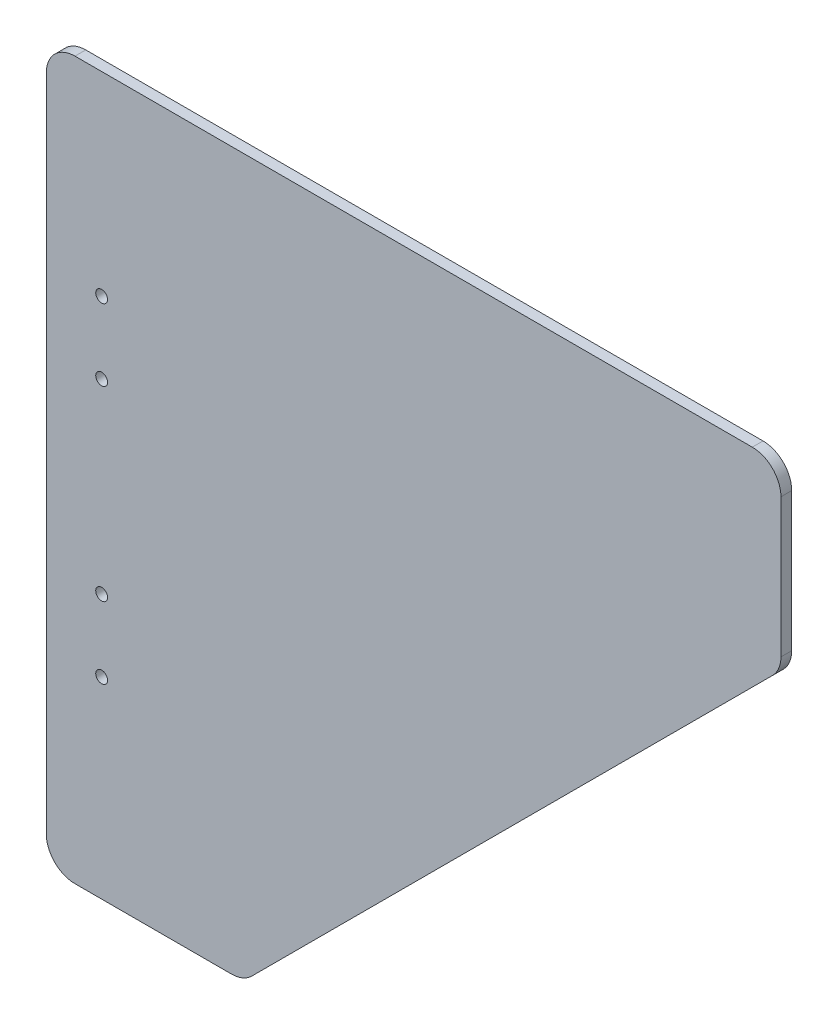
ISO-10303-21;
HEADER;
FILE_DESCRIPTION(('STEP AP214'),'2;1');
FILE_NAME('part.step','',(''),(''),'','','');
FILE_SCHEMA(('AUTOMOTIVE_DESIGN { 1 0 10303 214 1 1 1 1 }'));
ENDSEC;
DATA;
#1=APPLICATION_CONTEXT('core data for automotive mechanical design processes');
#2=APPLICATION_PROTOCOL_DEFINITION('international standard','automotive_design',2000,#1);
#3=PRODUCT_CONTEXT('',#1,'mechanical');
#4=PRODUCT('Part','Part','',(#3));
#5=PRODUCT_RELATED_PRODUCT_CATEGORY('part','',(#4));
#6=PRODUCT_DEFINITION_FORMATION('','',#4);
#7=PRODUCT_DEFINITION_CONTEXT('part definition',#1,'design');
#8=PRODUCT_DEFINITION('design','',#6,#7);
#9=PRODUCT_DEFINITION_SHAPE('','',#8);
#10=(LENGTH_UNIT() NAMED_UNIT(*) SI_UNIT(.MILLI.,.METRE.));
#11=(NAMED_UNIT(*) PLANE_ANGLE_UNIT() SI_UNIT($,.RADIAN.));
#12=(NAMED_UNIT(*) SI_UNIT($,.STERADIAN.) SOLID_ANGLE_UNIT());
#13=UNCERTAINTY_MEASURE_WITH_UNIT(LENGTH_MEASURE(1.E-05),#10,'distance_accuracy_value','');
#14=(GEOMETRIC_REPRESENTATION_CONTEXT(3) GLOBAL_UNCERTAINTY_ASSIGNED_CONTEXT((#13)) GLOBAL_UNIT_ASSIGNED_CONTEXT((#10,
#11,#12)) REPRESENTATION_CONTEXT('',''));
#15=CARTESIAN_POINT('',(0.,0.,0.));
#16=DIRECTION('',(0.,0.,1.));
#17=DIRECTION('',(1.,0.,0.));
#18=AXIS2_PLACEMENT_3D('',#15,#16,#17);
#19=CARTESIAN_POINT('',(51.6862915010169,8.00000000000001,3.));
#20=DIRECTION('',(0.,0.,-1.));
#21=DIRECTION('',(-1.,0.,0.));
#22=AXIS2_PLACEMENT_3D('',#19,#20,#21);
#23=CYLINDRICAL_SURFACE('',#22,8.00000000000001);
#24=CARTESIAN_POINT('',(51.6862915010169,8.00000000000001,0.));
#25=DIRECTION('',(0.,0.,1.));
#26=DIRECTION('',(-1.,0.,0.));
#27=AXIS2_PLACEMENT_3D('',#24,#25,#26);
#28=CIRCLE('',#27,8.00000000000001);
#29=CARTESIAN_POINT('',(51.6862915010169,0.,0.));
#30=VERTEX_POINT('',#29);
#31=CARTESIAN_POINT('',(57.3431457505093,2.34314575050765,0.));
#32=VERTEX_POINT('',#31);
#33=EDGE_CURVE('E144',#30,#32,#28,.T.);
#34=ORIENTED_EDGE('',*,*,#33,.T.);
#35=DIRECTION('',(0.,0.,-1.));
#36=VECTOR('',#35,1.);
#37=CARTESIAN_POINT('',(57.3431457505093,2.34314575050765,3.));
#38=LINE('',#37,#36);
#39=CARTESIAN_POINT('',(57.3431457505093,2.34314575050765,3.));
#40=VERTEX_POINT('',#39);
#41=EDGE_CURVE('E11',#40,#32,#38,.T.);
#42=ORIENTED_EDGE('',*,*,#41,.F.);
#43=CARTESIAN_POINT('',(51.6862915010169,8.00000000000001,3.));
#44=DIRECTION('',(0.,0.,1.));
#45=DIRECTION('',(-1.,0.,0.));
#46=AXIS2_PLACEMENT_3D('',#43,#44,#45);
#47=CIRCLE('',#46,8.00000000000001);
#48=CARTESIAN_POINT('',(51.6862915010169,0.,3.));
#49=VERTEX_POINT('',#48);
#50=EDGE_CURVE('E163',#49,#40,#47,.T.);
#51=ORIENTED_EDGE('',*,*,#50,.F.);
#52=DIRECTION('',(0.,0.,-1.));
#53=VECTOR('',#52,1.);
#54=CARTESIAN_POINT('',(51.6862915010169,0.,3.));
#55=LINE('',#54,#53);
#56=EDGE_CURVE('E140',#49,#30,#55,.T.);
#57=ORIENTED_EDGE('',*,*,#56,.T.);
#58=EDGE_LOOP('',(#34,#42,#51,#57));
#59=FACE_BOUND('',#58,.T.);
#60=ADVANCED_FACE('F35',(#59),#23,.T.);
#61=CARTESIAN_POINT('',(202.656854249492,147.656854249492,3.));
#62=DIRECTION('',(-0.707106781186552,0.707106781186543,0.));
#63=DIRECTION('',(-0.707106781186543,-0.707106781186552,0.));
#64=AXIS2_PLACEMENT_3D('',#61,#62,#63);
#65=PLANE('',#64);
#66=DIRECTION('',(0.707106781186543,0.707106781186552,0.));
#67=VECTOR('',#66,1.);
#68=CARTESIAN_POINT('',(202.656854249492,147.656854249492,0.));
#69=LINE('',#68,#67);
#70=CARTESIAN_POINT('',(202.656854249492,147.656854249492,0.));
#71=VERTEX_POINT('',#70);
#72=EDGE_CURVE('E147',#32,#71,#69,.T.);
#73=ORIENTED_EDGE('',*,*,#72,.T.);
#74=DIRECTION('',(0.,0.,-1.));
#75=VECTOR('',#74,1.);
#76=CARTESIAN_POINT('',(202.656854249492,147.656854249492,3.));
#77=LINE('',#76,#75);
#78=CARTESIAN_POINT('',(202.656854249492,147.656854249492,3.));
#79=VERTEX_POINT('',#78);
#80=EDGE_CURVE('E44',#79,#71,#77,.T.);
#81=ORIENTED_EDGE('',*,*,#80,.F.);
#82=DIRECTION('',(0.707106781186543,0.707106781186552,0.));
#83=VECTOR('',#82,1.);
#84=CARTESIAN_POINT('',(202.656854249492,147.656854249492,3.));
#85=LINE('',#84,#83);
#86=EDGE_CURVE('E101',#40,#79,#85,.T.);
#87=ORIENTED_EDGE('',*,*,#86,.F.);
#88=ORIENTED_EDGE('',*,*,#41,.T.);
#89=EDGE_LOOP('',(#73,#81,#87,#88));
#90=FACE_BOUND('',#89,.T.);
#91=ADVANCED_FACE('F263',(#90),#65,.F.);
#92=CARTESIAN_POINT('',(197.,153.313708498985,3.));
#93=DIRECTION('',(0.,0.,-1.));
#94=DIRECTION('',(-1.,0.,0.));
#95=AXIS2_PLACEMENT_3D('',#92,#93,#94);
#96=CYLINDRICAL_SURFACE('',#95,8.);
#97=CARTESIAN_POINT('',(197.,153.313708498985,0.));
#98=DIRECTION('',(0.,0.,1.));
#99=DIRECTION('',(-1.,0.,0.));
#100=AXIS2_PLACEMENT_3D('',#97,#98,#99);
#101=CIRCLE('',#100,8.);
#102=CARTESIAN_POINT('',(205.,153.313708498985,0.));
#103=VERTEX_POINT('',#102);
#104=EDGE_CURVE('E150',#71,#103,#101,.T.);
#105=ORIENTED_EDGE('',*,*,#104,.T.);
#106=DIRECTION('',(0.,0.,-1.));
#107=VECTOR('',#106,1.);
#108=CARTESIAN_POINT('',(205.,153.313708498985,3.));
#109=LINE('',#108,#107);
#110=CARTESIAN_POINT('',(205.,153.313708498985,3.));
#111=VERTEX_POINT('',#110);
#112=EDGE_CURVE('E176',#111,#103,#109,.T.);
#113=ORIENTED_EDGE('',*,*,#112,.F.);
#114=CARTESIAN_POINT('',(197.,153.313708498985,3.));
#115=DIRECTION('',(0.,0.,1.));
#116=DIRECTION('',(-1.,0.,0.));
#117=AXIS2_PLACEMENT_3D('',#114,#115,#116);
#118=CIRCLE('',#117,8.);
#119=EDGE_CURVE('E185',#79,#111,#118,.T.);
#120=ORIENTED_EDGE('',*,*,#119,.F.);
#121=ORIENTED_EDGE('',*,*,#80,.T.);
#122=EDGE_LOOP('',(#105,#113,#120,#121));
#123=FACE_BOUND('',#122,.T.);
#124=ADVANCED_FACE('F183',(#123),#96,.T.);
#125=CARTESIAN_POINT('',(205.,192.,3.));
#126=DIRECTION('',(-1.,0.,0.));
#127=DIRECTION('',(0.,0.,1.));
#128=AXIS2_PLACEMENT_3D('',#125,#126,#127);
#129=PLANE('',#128);
#130=DIRECTION('',(0.,1.,0.));
#131=VECTOR('',#130,1.);
#132=CARTESIAN_POINT('',(205.,192.,0.));
#133=LINE('',#132,#131);
#134=CARTESIAN_POINT('',(205.,192.,0.));
#135=VERTEX_POINT('',#134);
#136=EDGE_CURVE('E152',#103,#135,#133,.T.);
#137=ORIENTED_EDGE('',*,*,#136,.T.);
#138=DIRECTION('',(0.,0.,-1.));
#139=VECTOR('',#138,1.);
#140=CARTESIAN_POINT('',(205.,192.,3.));
#141=LINE('',#140,#139);
#142=CARTESIAN_POINT('',(205.,192.,3.));
#143=VERTEX_POINT('',#142);
#144=EDGE_CURVE('E173',#143,#135,#141,.T.);
#145=ORIENTED_EDGE('',*,*,#144,.F.);
#146=DIRECTION('',(0.,1.,0.));
#147=VECTOR('',#146,1.);
#148=CARTESIAN_POINT('',(205.,192.,3.));
#149=LINE('',#148,#147);
#150=EDGE_CURVE('E203',#111,#143,#149,.T.);
#151=ORIENTED_EDGE('',*,*,#150,.F.);
#152=ORIENTED_EDGE('',*,*,#112,.T.);
#153=EDGE_LOOP('',(#137,#145,#151,#152));
#154=FACE_BOUND('',#153,.T.);
#155=ADVANCED_FACE('F194',(#154),#129,.F.);
#156=CARTESIAN_POINT('',(197.,192.,3.));
#157=DIRECTION('',(0.,0.,-1.));
#158=DIRECTION('',(-1.,0.,0.));
#159=AXIS2_PLACEMENT_3D('',#156,#157,#158);
#160=CYLINDRICAL_SURFACE('',#159,8.00000000000001);
#161=CARTESIAN_POINT('',(197.,192.,0.));
#162=DIRECTION('',(0.,0.,1.));
#163=DIRECTION('',(-1.,0.,0.));
#164=AXIS2_PLACEMENT_3D('',#161,#162,#163);
#165=CIRCLE('',#164,8.00000000000001);
#166=CARTESIAN_POINT('',(197.,200.,0.));
#167=VERTEX_POINT('',#166);
#168=EDGE_CURVE('E154',#135,#167,#165,.T.);
#169=ORIENTED_EDGE('',*,*,#168,.T.);
#170=DIRECTION('',(0.,0.,-1.));
#171=VECTOR('',#170,1.);
#172=CARTESIAN_POINT('',(197.,200.,3.));
#173=LINE('',#172,#171);
#174=CARTESIAN_POINT('',(197.,200.,3.));
#175=VERTEX_POINT('',#174);
#176=EDGE_CURVE('E170',#175,#167,#173,.T.);
#177=ORIENTED_EDGE('',*,*,#176,.F.);
#178=CARTESIAN_POINT('',(197.,192.,3.));
#179=DIRECTION('',(0.,0.,1.));
#180=DIRECTION('',(-1.,0.,0.));
#181=AXIS2_PLACEMENT_3D('',#178,#179,#180);
#182=CIRCLE('',#181,8.00000000000001);
#183=EDGE_CURVE('E200',#143,#175,#182,.T.);
#184=ORIENTED_EDGE('',*,*,#183,.F.);
#185=ORIENTED_EDGE('',*,*,#144,.T.);
#186=EDGE_LOOP('',(#169,#177,#184,#185));
#187=FACE_BOUND('',#186,.T.);
#188=ADVANCED_FACE('F198',(#187),#160,.T.);
#189=CARTESIAN_POINT('',(8.,200.,3.));
#190=DIRECTION('',(0.,-1.,0.));
#191=DIRECTION('',(0.,0.,-1.));
#192=AXIS2_PLACEMENT_3D('',#189,#190,#191);
#193=PLANE('',#192);
#194=DIRECTION('',(-1.,0.,0.));
#195=VECTOR('',#194,1.);
#196=CARTESIAN_POINT('',(8.,200.,0.));
#197=LINE('',#196,#195);
#198=CARTESIAN_POINT('',(8.,200.,0.));
#199=VERTEX_POINT('',#198);
#200=EDGE_CURVE('E156',#167,#199,#197,.T.);
#201=ORIENTED_EDGE('',*,*,#200,.T.);
#202=DIRECTION('',(0.,0.,-1.));
#203=VECTOR('',#202,1.);
#204=CARTESIAN_POINT('',(8.,200.,3.));
#205=LINE('',#204,#203);
#206=CARTESIAN_POINT('',(8.,200.,3.));
#207=VERTEX_POINT('',#206);
#208=EDGE_CURVE('E167',#207,#199,#205,.T.);
#209=ORIENTED_EDGE('',*,*,#208,.F.);
#210=DIRECTION('',(-1.,0.,0.));
#211=VECTOR('',#210,1.);
#212=CARTESIAN_POINT('',(8.,200.,3.));
#213=LINE('',#212,#211);
#214=EDGE_CURVE('E202',#175,#207,#213,.T.);
#215=ORIENTED_EDGE('',*,*,#214,.F.);
#216=ORIENTED_EDGE('',*,*,#176,.T.);
#217=EDGE_LOOP('',(#201,#209,#215,#216));
#218=FACE_BOUND('',#217,.T.);
#219=ADVANCED_FACE('F275',(#218),#193,.F.);
#220=CARTESIAN_POINT('',(8.,192.,3.));
#221=DIRECTION('',(0.,0.,-1.));
#222=DIRECTION('',(-1.,0.,0.));
#223=AXIS2_PLACEMENT_3D('',#220,#221,#222);
#224=CYLINDRICAL_SURFACE('',#223,8.);
#225=CARTESIAN_POINT('',(8.,192.,0.));
#226=DIRECTION('',(0.,0.,1.));
#227=DIRECTION('',(1.,0.,0.));
#228=AXIS2_PLACEMENT_3D('',#225,#226,#227);
#229=CIRCLE('',#228,8.);
#230=CARTESIAN_POINT('',(0.,192.,0.));
#231=VERTEX_POINT('',#230);
#232=EDGE_CURVE('E158',#199,#231,#229,.T.);
#233=ORIENTED_EDGE('',*,*,#232,.T.);
#234=DIRECTION('',(0.,0.,-1.));
#235=VECTOR('',#234,1.);
#236=CARTESIAN_POINT('',(0.,192.,3.));
#237=LINE('',#236,#235);
#238=CARTESIAN_POINT('',(0.,192.,3.));
#239=VERTEX_POINT('',#238);
#240=EDGE_CURVE('E135',#239,#231,#237,.T.);
#241=ORIENTED_EDGE('',*,*,#240,.F.);
#242=CARTESIAN_POINT('',(8.,192.,3.));
#243=DIRECTION('',(0.,0.,1.));
#244=DIRECTION('',(1.,0.,0.));
#245=AXIS2_PLACEMENT_3D('',#242,#243,#244);
#246=CIRCLE('',#245,8.);
#247=EDGE_CURVE('E126',#207,#239,#246,.T.);
#248=ORIENTED_EDGE('',*,*,#247,.F.);
#249=ORIENTED_EDGE('',*,*,#208,.T.);
#250=EDGE_LOOP('',(#233,#241,#248,#249));
#251=FACE_BOUND('',#250,.T.);
#252=ADVANCED_FACE('F272',(#251),#224,.T.);
#253=CARTESIAN_POINT('',(0.,7.99999999999999,3.));
#254=DIRECTION('',(1.,0.,0.));
#255=DIRECTION('',(0.,1.,0.));
#256=AXIS2_PLACEMENT_3D('',#253,#254,#255);
#257=PLANE('',#256);
#258=DIRECTION('',(0.,-1.,0.));
#259=VECTOR('',#258,1.);
#260=CARTESIAN_POINT('',(0.,7.99999999999999,0.));
#261=LINE('',#260,#259);
#262=CARTESIAN_POINT('',(0.,7.99999999999999,0.));
#263=VERTEX_POINT('',#262);
#264=EDGE_CURVE('E134',#231,#263,#261,.T.);
#265=ORIENTED_EDGE('',*,*,#264,.T.);
#266=DIRECTION('',(0.,0.,-1.));
#267=VECTOR('',#266,1.);
#268=CARTESIAN_POINT('',(0.,7.99999999999999,3.));
#269=LINE('',#268,#267);
#270=CARTESIAN_POINT('',(0.,7.99999999999999,3.));
#271=VERTEX_POINT('',#270);
#272=EDGE_CURVE('E131',#271,#263,#269,.T.);
#273=ORIENTED_EDGE('',*,*,#272,.F.);
#274=DIRECTION('',(0.,-1.,0.));
#275=VECTOR('',#274,1.);
#276=CARTESIAN_POINT('',(0.,7.99999999999999,3.));
#277=LINE('',#276,#275);
#278=EDGE_CURVE('E120',#239,#271,#277,.T.);
#279=ORIENTED_EDGE('',*,*,#278,.F.);
#280=ORIENTED_EDGE('',*,*,#240,.T.);
#281=EDGE_LOOP('',(#265,#273,#279,#280));
#282=FACE_BOUND('',#281,.T.);
#283=ADVANCED_FACE('F132',(#282),#257,.F.);
#284=CARTESIAN_POINT('',(8.,7.99999999999999,3.));
#285=DIRECTION('',(0.,0.,-1.));
#286=DIRECTION('',(-1.,0.,0.));
#287=AXIS2_PLACEMENT_3D('',#284,#285,#286);
#288=CYLINDRICAL_SURFACE('',#287,8.);
#289=CARTESIAN_POINT('',(8.,7.99999999999999,0.));
#290=DIRECTION('',(0.,0.,1.));
#291=DIRECTION('',(1.,0.,0.));
#292=AXIS2_PLACEMENT_3D('',#289,#290,#291);
#293=CIRCLE('',#292,8.);
#294=CARTESIAN_POINT('',(8.,0.,0.));
#295=VERTEX_POINT('',#294);
#296=EDGE_CURVE('E87',#263,#295,#293,.T.);
#297=ORIENTED_EDGE('',*,*,#296,.T.);
#298=DIRECTION('',(0.,0.,-1.));
#299=VECTOR('',#298,1.);
#300=CARTESIAN_POINT('',(8.,0.,3.));
#301=LINE('',#300,#299);
#302=CARTESIAN_POINT('',(8.,0.,3.));
#303=VERTEX_POINT('',#302);
#304=EDGE_CURVE('E136',#303,#295,#301,.T.);
#305=ORIENTED_EDGE('',*,*,#304,.F.);
#306=CARTESIAN_POINT('',(8.,7.99999999999999,3.));
#307=DIRECTION('',(0.,0.,1.));
#308=DIRECTION('',(1.,0.,0.));
#309=AXIS2_PLACEMENT_3D('',#306,#307,#308);
#310=CIRCLE('',#309,8.);
#311=EDGE_CURVE('E124',#271,#303,#310,.T.);
#312=ORIENTED_EDGE('',*,*,#311,.F.);
#313=ORIENTED_EDGE('',*,*,#272,.T.);
#314=EDGE_LOOP('',(#297,#305,#312,#313));
#315=FACE_BOUND('',#314,.T.);
#316=ADVANCED_FACE('F138',(#315),#288,.T.);
#317=CARTESIAN_POINT('',(51.6862915010169,0.,3.));
#318=DIRECTION('',(0.,1.,0.));
#319=DIRECTION('',(-1.,0.,0.));
#320=AXIS2_PLACEMENT_3D('',#317,#318,#319);
#321=PLANE('',#320);
#322=DIRECTION('',(1.,0.,0.));
#323=VECTOR('',#322,1.);
#324=CARTESIAN_POINT('',(51.6862915010169,0.,0.));
#325=LINE('',#324,#323);
#326=EDGE_CURVE('E93',#295,#30,#325,.T.);
#327=ORIENTED_EDGE('',*,*,#326,.T.);
#328=ORIENTED_EDGE('',*,*,#56,.F.);
#329=DIRECTION('',(1.,0.,0.));
#330=VECTOR('',#329,1.);
#331=CARTESIAN_POINT('',(51.6862915010169,0.,3.));
#332=LINE('',#331,#330);
#333=EDGE_CURVE('E52',#303,#49,#332,.T.);
#334=ORIENTED_EDGE('',*,*,#333,.F.);
#335=ORIENTED_EDGE('',*,*,#304,.T.);
#336=EDGE_LOOP('',(#327,#328,#334,#335));
#337=FACE_BOUND('',#336,.T.);
#338=ADVANCED_FACE('F254',(#337),#321,.F.);
#339=CARTESIAN_POINT('',(51.6862915010169,8.00000000000001,3.));
#340=DIRECTION('',(0.,0.,-1.));
#341=DIRECTION('',(-1.,0.,0.));
#342=AXIS2_PLACEMENT_3D('',#339,#340,#341);
#343=PLANE('',#342);
#344=CARTESIAN_POINT('',(15.442695020107,145.7,3.));
#345=DIRECTION('',(0.,0.,1.));
#346=DIRECTION('',(1.,0.,0.));
#347=AXIS2_PLACEMENT_3D('',#344,#345,#346);
#348=CIRCLE('',#347,1.64999999999999);
#349=CARTESIAN_POINT('',(17.092695020107,145.7,3.));
#350=VERTEX_POINT('',#349);
#351=EDGE_CURVE('E228',#350,#350,#348,.T.);
#352=ORIENTED_EDGE('',*,*,#351,.F.);
#353=EDGE_LOOP('',(#352));
#354=FACE_BOUND('',#353,.T.);
#355=CARTESIAN_POINT('',(15.4426950201071,125.7,3.));
#356=DIRECTION('',(0.,0.,1.));
#357=DIRECTION('',(1.,0.,0.));
#358=AXIS2_PLACEMENT_3D('',#355,#356,#357);
#359=CIRCLE('',#358,1.64999999999999);
#360=CARTESIAN_POINT('',(17.0926950201071,125.7,3.));
#361=VERTEX_POINT('',#360);
#362=EDGE_CURVE('E225',#361,#361,#359,.T.);
#363=ORIENTED_EDGE('',*,*,#362,.F.);
#364=EDGE_LOOP('',(#363));
#365=FACE_BOUND('',#364,.T.);
#366=CARTESIAN_POINT('',(15.4426950201071,73.6999999999999,3.));
#367=DIRECTION('',(0.,0.,1.));
#368=DIRECTION('',(1.,0.,0.));
#369=AXIS2_PLACEMENT_3D('',#366,#367,#368);
#370=CIRCLE('',#369,1.64999999999999);
#371=CARTESIAN_POINT('',(17.0926950201071,73.6999999999999,3.));
#372=VERTEX_POINT('',#371);
#373=EDGE_CURVE('E219',#372,#372,#370,.T.);
#374=ORIENTED_EDGE('',*,*,#373,.F.);
#375=EDGE_LOOP('',(#374));
#376=FACE_BOUND('',#375,.T.);
#377=CARTESIAN_POINT('',(15.4426950201071,53.6999999999999,3.));
#378=DIRECTION('',(0.,0.,1.));
#379=DIRECTION('',(1.,0.,0.));
#380=AXIS2_PLACEMENT_3D('',#377,#378,#379);
#381=CIRCLE('',#380,1.64999999999999);
#382=CARTESIAN_POINT('',(17.0926950201071,53.6999999999999,3.));
#383=VERTEX_POINT('',#382);
#384=EDGE_CURVE('E213',#383,#383,#381,.T.);
#385=ORIENTED_EDGE('',*,*,#384,.F.);
#386=EDGE_LOOP('',(#385));
#387=FACE_BOUND('',#386,.T.);
#388=ORIENTED_EDGE('',*,*,#50,.T.);
#389=ORIENTED_EDGE('',*,*,#86,.T.);
#390=ORIENTED_EDGE('',*,*,#119,.T.);
#391=ORIENTED_EDGE('',*,*,#150,.T.);
#392=ORIENTED_EDGE('',*,*,#183,.T.);
#393=ORIENTED_EDGE('',*,*,#214,.T.);
#394=ORIENTED_EDGE('',*,*,#247,.T.);
#395=ORIENTED_EDGE('',*,*,#278,.T.);
#396=ORIENTED_EDGE('',*,*,#311,.T.);
#397=ORIENTED_EDGE('',*,*,#333,.T.);
#398=EDGE_LOOP('',(#388,#389,#390,#391,#392,#393,#394,#395,#396,#397));
#399=FACE_BOUND('',#398,.T.);
#400=ADVANCED_FACE('F122',(#354,#365,#376,#387,#399),#343,.F.);
#401=CARTESIAN_POINT('',(51.6862915010169,8.00000000000001,0.));
#402=DIRECTION('',(0.,0.,-1.));
#403=DIRECTION('',(-1.,0.,0.));
#404=AXIS2_PLACEMENT_3D('',#401,#402,#403);
#405=PLANE('',#404);
#406=CARTESIAN_POINT('',(15.442695020107,145.7,0.));
#407=DIRECTION('',(0.,0.,-1.));
#408=DIRECTION('',(-1.,0.,0.));
#409=AXIS2_PLACEMENT_3D('',#406,#407,#408);
#410=CIRCLE('',#409,1.64999999999999);
#411=CARTESIAN_POINT('',(13.7926950201071,145.7,0.));
#412=VERTEX_POINT('',#411);
#413=EDGE_CURVE('E38',#412,#412,#410,.T.);
#414=ORIENTED_EDGE('',*,*,#413,.F.);
#415=EDGE_LOOP('',(#414));
#416=FACE_BOUND('',#415,.T.);
#417=CARTESIAN_POINT('',(15.4426950201071,125.7,0.));
#418=DIRECTION('',(0.,0.,-1.));
#419=DIRECTION('',(-1.,0.,0.));
#420=AXIS2_PLACEMENT_3D('',#417,#418,#419);
#421=CIRCLE('',#420,1.64999999999999);
#422=CARTESIAN_POINT('',(13.7926950201071,125.7,0.));
#423=VERTEX_POINT('',#422);
#424=EDGE_CURVE('E222',#423,#423,#421,.T.);
#425=ORIENTED_EDGE('',*,*,#424,.F.);
#426=EDGE_LOOP('',(#425));
#427=FACE_BOUND('',#426,.T.);
#428=CARTESIAN_POINT('',(15.4426950201071,73.6999999999999,0.));
#429=DIRECTION('',(0.,0.,-1.));
#430=DIRECTION('',(-1.,0.,0.));
#431=AXIS2_PLACEMENT_3D('',#428,#429,#430);
#432=CIRCLE('',#431,1.64999999999999);
#433=CARTESIAN_POINT('',(13.7926950201071,73.6999999999999,0.));
#434=VERTEX_POINT('',#433);
#435=EDGE_CURVE('E216',#434,#434,#432,.T.);
#436=ORIENTED_EDGE('',*,*,#435,.F.);
#437=EDGE_LOOP('',(#436));
#438=FACE_BOUND('',#437,.T.);
#439=CARTESIAN_POINT('',(15.4426950201071,53.6999999999999,0.));
#440=DIRECTION('',(0.,0.,-1.));
#441=DIRECTION('',(-1.,0.,0.));
#442=AXIS2_PLACEMENT_3D('',#439,#440,#441);
#443=CIRCLE('',#442,1.64999999999999);
#444=CARTESIAN_POINT('',(13.7926950201071,53.6999999999999,0.));
#445=VERTEX_POINT('',#444);
#446=EDGE_CURVE('E148',#445,#445,#443,.T.);
#447=ORIENTED_EDGE('',*,*,#446,.F.);
#448=EDGE_LOOP('',(#447));
#449=FACE_BOUND('',#448,.T.);
#450=ORIENTED_EDGE('',*,*,#33,.F.);
#451=ORIENTED_EDGE('',*,*,#326,.F.);
#452=ORIENTED_EDGE('',*,*,#296,.F.);
#453=ORIENTED_EDGE('',*,*,#264,.F.);
#454=ORIENTED_EDGE('',*,*,#232,.F.);
#455=ORIENTED_EDGE('',*,*,#200,.F.);
#456=ORIENTED_EDGE('',*,*,#168,.F.);
#457=ORIENTED_EDGE('',*,*,#136,.F.);
#458=ORIENTED_EDGE('',*,*,#104,.F.);
#459=ORIENTED_EDGE('',*,*,#72,.F.);
#460=EDGE_LOOP('',(#450,#451,#452,#453,#454,#455,#456,#457,#458,#459));
#461=FACE_BOUND('',#460,.T.);
#462=ADVANCED_FACE('F189',(#416,#427,#438,#449,#461),#405,.T.);
#463=CARTESIAN_POINT('',(15.4426950201071,53.6999999999999,3.));
#464=DIRECTION('',(0.,0.,1.));
#465=DIRECTION('',(1.,0.,0.));
#466=AXIS2_PLACEMENT_3D('',#463,#464,#465);
#467=CYLINDRICAL_SURFACE('',#466,1.64999999999999);
#468=ORIENTED_EDGE('',*,*,#446,.T.);
#469=EDGE_LOOP('',(#468));
#470=FACE_BOUND('',#469,.T.);
#471=ORIENTED_EDGE('',*,*,#384,.T.);
#472=EDGE_LOOP('',(#471));
#473=FACE_BOUND('',#472,.T.);
#474=ADVANCED_FACE('F239',(#470,#473),#467,.F.);
#475=CARTESIAN_POINT('',(15.4426950201071,73.6999999999999,3.));
#476=DIRECTION('',(0.,0.,1.));
#477=DIRECTION('',(1.,0.,0.));
#478=AXIS2_PLACEMENT_3D('',#475,#476,#477);
#479=CYLINDRICAL_SURFACE('',#478,1.64999999999999);
#480=ORIENTED_EDGE('',*,*,#435,.T.);
#481=EDGE_LOOP('',(#480));
#482=FACE_BOUND('',#481,.T.);
#483=ORIENTED_EDGE('',*,*,#373,.T.);
#484=EDGE_LOOP('',(#483));
#485=FACE_BOUND('',#484,.T.);
#486=ADVANCED_FACE('F249',(#482,#485),#479,.F.);
#487=CARTESIAN_POINT('',(15.4426950201071,125.7,3.));
#488=DIRECTION('',(0.,0.,1.));
#489=DIRECTION('',(1.,0.,0.));
#490=AXIS2_PLACEMENT_3D('',#487,#488,#489);
#491=CYLINDRICAL_SURFACE('',#490,1.64999999999999);
#492=ORIENTED_EDGE('',*,*,#424,.T.);
#493=EDGE_LOOP('',(#492));
#494=FACE_BOUND('',#493,.T.);
#495=ORIENTED_EDGE('',*,*,#362,.T.);
#496=EDGE_LOOP('',(#495));
#497=FACE_BOUND('',#496,.T.);
#498=ADVANCED_FACE('F359',(#494,#497),#491,.F.);
#499=CARTESIAN_POINT('',(15.442695020107,145.7,3.));
#500=DIRECTION('',(0.,0.,1.));
#501=DIRECTION('',(1.,0.,0.));
#502=AXIS2_PLACEMENT_3D('',#499,#500,#501);
#503=CYLINDRICAL_SURFACE('',#502,1.64999999999999);
#504=ORIENTED_EDGE('',*,*,#413,.T.);
#505=EDGE_LOOP('',(#504));
#506=FACE_BOUND('',#505,.T.);
#507=ORIENTED_EDGE('',*,*,#351,.T.);
#508=EDGE_LOOP('',(#507));
#509=FACE_BOUND('',#508,.T.);
#510=ADVANCED_FACE('F235',(#506,#509),#503,.F.);
#511=CLOSED_SHELL('',(#60,#91,#124,#155,#188,#219,#252,#283,#316,#338,#400,#462,#474,#486,#498,#510));
#512=MANIFOLD_SOLID_BREP('B2',#511);
#513=ADVANCED_BREP_SHAPE_REPRESENTATION('',(#18,#512),#14);
#514=SHAPE_DEFINITION_REPRESENTATION(#9,#513);
ENDSEC;
END-ISO-10303-21;
